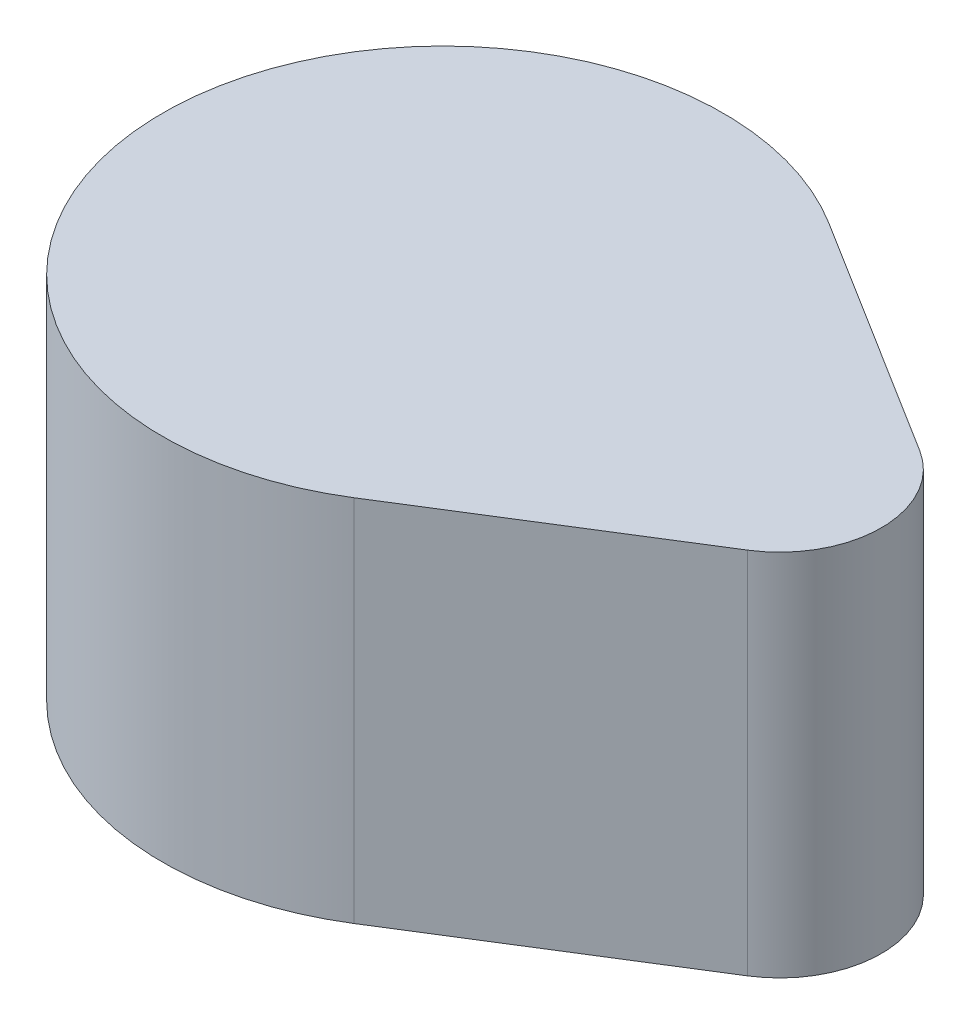
ISO-10303-21;
HEADER;
FILE_DESCRIPTION(('STEP AP214'),'2;1');
FILE_NAME('part.step','',(''),(''),'','','');
FILE_SCHEMA(('AUTOMOTIVE_DESIGN { 1 0 10303 214 1 1 1 1 }'));
ENDSEC;
DATA;
#1=APPLICATION_CONTEXT('core data for automotive mechanical design processes');
#2=APPLICATION_PROTOCOL_DEFINITION('international standard','automotive_design',2000,#1);
#3=PRODUCT_CONTEXT('',#1,'mechanical');
#4=PRODUCT('Part','Part','',(#3));
#5=PRODUCT_RELATED_PRODUCT_CATEGORY('part','',(#4));
#6=PRODUCT_DEFINITION_FORMATION('','',#4);
#7=PRODUCT_DEFINITION_CONTEXT('part definition',#1,'design');
#8=PRODUCT_DEFINITION('design','',#6,#7);
#9=PRODUCT_DEFINITION_SHAPE('','',#8);
#10=(LENGTH_UNIT() NAMED_UNIT(*) SI_UNIT(.MILLI.,.METRE.));
#11=(NAMED_UNIT(*) PLANE_ANGLE_UNIT() SI_UNIT($,.RADIAN.));
#12=(NAMED_UNIT(*) SI_UNIT($,.STERADIAN.) SOLID_ANGLE_UNIT());
#13=UNCERTAINTY_MEASURE_WITH_UNIT(LENGTH_MEASURE(1.E-05),#10,'distance_accuracy_value','');
#14=(GEOMETRIC_REPRESENTATION_CONTEXT(3) GLOBAL_UNCERTAINTY_ASSIGNED_CONTEXT((#13)) GLOBAL_UNIT_ASSIGNED_CONTEXT((#10,
#11,#12)) REPRESENTATION_CONTEXT('',''));
#15=CARTESIAN_POINT('',(0.,0.,0.));
#16=DIRECTION('',(0.,0.,1.));
#17=DIRECTION('',(1.,0.,0.));
#18=AXIS2_PLACEMENT_3D('',#15,#16,#17);
#19=CARTESIAN_POINT('',(0.,12.7,0.));
#20=DIRECTION('',(0.,-1.,0.));
#21=DIRECTION('',(0.,0.,-1.));
#22=AXIS2_PLACEMENT_3D('',#19,#20,#21);
#23=CYLINDRICAL_SURFACE('',#22,9.65);
#24=CARTESIAN_POINT('',(0.,0.,0.));
#25=DIRECTION('',(0.,1.,0.));
#26=DIRECTION('',(0.,0.,1.));
#27=AXIS2_PLACEMENT_3D('',#24,#25,#26);
#28=CIRCLE('',#27,9.65);
#29=CARTESIAN_POINT('',(5.11616379310345,0.,-8.18213713171182));
#30=VERTEX_POINT('',#29);
#31=CARTESIAN_POINT('',(5.11616379310345,0.,8.18213713171182));
#32=VERTEX_POINT('',#31);
#33=EDGE_CURVE('E107',#30,#32,#28,.T.);
#34=ORIENTED_EDGE('',*,*,#33,.T.);
#35=DIRECTION('',(0.,-1.,0.));
#36=VECTOR('',#35,1.);
#37=CARTESIAN_POINT('',(5.11616379310345,12.7,8.18213713171182));
#38=LINE('',#37,#36);
#39=CARTESIAN_POINT('',(5.11616379310345,12.7,8.18213713171182));
#40=VERTEX_POINT('',#39);
#41=EDGE_CURVE('E11',#40,#32,#38,.T.);
#42=ORIENTED_EDGE('',*,*,#41,.F.);
#43=CARTESIAN_POINT('',(0.,12.7,0.));
#44=DIRECTION('',(0.,1.,0.));
#45=DIRECTION('',(0.,0.,1.));
#46=AXIS2_PLACEMENT_3D('',#43,#44,#45);
#47=CIRCLE('',#46,9.65);
#48=CARTESIAN_POINT('',(5.11616379310345,12.7,-8.18213713171182));
#49=VERTEX_POINT('',#48);
#50=EDGE_CURVE('E91',#49,#40,#47,.T.);
#51=ORIENTED_EDGE('',*,*,#50,.F.);
#52=DIRECTION('',(0.,-1.,0.));
#53=VECTOR('',#52,1.);
#54=CARTESIAN_POINT('',(5.11616379310345,12.7,-8.18213713171182));
#55=LINE('',#54,#53);
#56=EDGE_CURVE('E103',#49,#30,#55,.T.);
#57=ORIENTED_EDGE('',*,*,#56,.T.);
#58=EDGE_LOOP('',(#34,#42,#51,#57));
#59=FACE_BOUND('',#58,.T.);
#60=ADVANCED_FACE('F39',(#59),#23,.T.);
#61=CARTESIAN_POINT('',(5.11616379310345,12.7,8.18213713171182));
#62=DIRECTION('',(-0.530172413793103,0.,-0.847889858208479));
#63=DIRECTION('',(-0.847889858208479,0.,0.530172413793103));
#64=AXIS2_PLACEMENT_3D('',#61,#62,#63);
#65=PLANE('',#64);
#66=DIRECTION('',(0.847889858208479,0.,-0.530172413793103));
#67=VECTOR('',#66,1.);
#68=CARTESIAN_POINT('',(5.11616379310345,0.,8.18213713171182));
#69=LINE('',#68,#67);
#70=CARTESIAN_POINT('',(13.4556034482759,0.,2.96761450372968));
#71=VERTEX_POINT('',#70);
#72=EDGE_CURVE('E96',#32,#71,#69,.T.);
#73=ORIENTED_EDGE('',*,*,#72,.T.);
#74=DIRECTION('',(0.,-1.,0.));
#75=VECTOR('',#74,1.);
#76=CARTESIAN_POINT('',(13.4556034482759,12.7,2.96761450372968));
#77=LINE('',#76,#75);
#78=CARTESIAN_POINT('',(13.4556034482759,12.7,2.96761450372968));
#79=VERTEX_POINT('',#78);
#80=EDGE_CURVE('E48',#79,#71,#77,.T.);
#81=ORIENTED_EDGE('',*,*,#80,.F.);
#82=DIRECTION('',(0.847889858208479,0.,-0.530172413793103));
#83=VECTOR('',#82,1.);
#84=CARTESIAN_POINT('',(5.11616379310345,12.7,8.18213713171182));
#85=LINE('',#84,#83);
#86=EDGE_CURVE('E86',#40,#79,#85,.T.);
#87=ORIENTED_EDGE('',*,*,#86,.F.);
#88=ORIENTED_EDGE('',*,*,#41,.T.);
#89=EDGE_LOOP('',(#73,#81,#87,#88));
#90=FACE_BOUND('',#89,.T.);
#91=ADVANCED_FACE('F95',(#90),#65,.F.);
#92=CARTESIAN_POINT('',(11.6,12.7,0.));
#93=DIRECTION('',(0.,-1.,0.));
#94=DIRECTION('',(0.,0.,-1.));
#95=AXIS2_PLACEMENT_3D('',#92,#93,#94);
#96=CYLINDRICAL_SURFACE('',#95,3.5);
#97=CARTESIAN_POINT('',(11.6,0.,0.));
#98=DIRECTION('',(0.,1.,0.));
#99=DIRECTION('',(0.,0.,1.));
#100=AXIS2_PLACEMENT_3D('',#97,#98,#99);
#101=CIRCLE('',#100,3.5);
#102=CARTESIAN_POINT('',(13.4556034482759,0.,-2.96761450372968));
#103=VERTEX_POINT('',#102);
#104=EDGE_CURVE('E73',#71,#103,#101,.T.);
#105=ORIENTED_EDGE('',*,*,#104,.T.);
#106=DIRECTION('',(0.,-1.,0.));
#107=VECTOR('',#106,1.);
#108=CARTESIAN_POINT('',(13.4556034482759,12.7,-2.96761450372968));
#109=LINE('',#108,#107);
#110=CARTESIAN_POINT('',(13.4556034482759,12.7,-2.96761450372968));
#111=VERTEX_POINT('',#110);
#112=EDGE_CURVE('E98',#111,#103,#109,.T.);
#113=ORIENTED_EDGE('',*,*,#112,.F.);
#114=CARTESIAN_POINT('',(11.6,12.7,0.));
#115=DIRECTION('',(0.,1.,0.));
#116=DIRECTION('',(0.,0.,1.));
#117=AXIS2_PLACEMENT_3D('',#114,#115,#116);
#118=CIRCLE('',#117,3.5);
#119=EDGE_CURVE('E89',#79,#111,#118,.T.);
#120=ORIENTED_EDGE('',*,*,#119,.F.);
#121=ORIENTED_EDGE('',*,*,#80,.T.);
#122=EDGE_LOOP('',(#105,#113,#120,#121));
#123=FACE_BOUND('',#122,.T.);
#124=ADVANCED_FACE('F99',(#123),#96,.T.);
#125=CARTESIAN_POINT('',(5.11616379310345,12.7,-8.18213713171182));
#126=DIRECTION('',(-0.530172413793103,0.,0.847889858208479));
#127=DIRECTION('',(0.847889858208479,0.,0.530172413793103));
#128=AXIS2_PLACEMENT_3D('',#125,#126,#127);
#129=PLANE('',#128);
#130=DIRECTION('',(-0.847889858208479,0.,-0.530172413793103));
#131=VECTOR('',#130,1.);
#132=CARTESIAN_POINT('',(5.11616379310345,0.,-8.18213713171182));
#133=LINE('',#132,#131);
#134=EDGE_CURVE('E79',#103,#30,#133,.T.);
#135=ORIENTED_EDGE('',*,*,#134,.T.);
#136=ORIENTED_EDGE('',*,*,#56,.F.);
#137=DIRECTION('',(-0.847889858208479,0.,-0.530172413793103));
#138=VECTOR('',#137,1.);
#139=CARTESIAN_POINT('',(5.11616379310345,12.7,-8.18213713171182));
#140=LINE('',#139,#138);
#141=EDGE_CURVE('E56',#111,#49,#140,.T.);
#142=ORIENTED_EDGE('',*,*,#141,.F.);
#143=ORIENTED_EDGE('',*,*,#112,.T.);
#144=EDGE_LOOP('',(#135,#136,#142,#143));
#145=FACE_BOUND('',#144,.T.);
#146=ADVANCED_FACE('F120',(#145),#129,.F.);
#147=CARTESIAN_POINT('',(0.,12.7,0.));
#148=DIRECTION('',(0.,1.,0.));
#149=DIRECTION('',(0.,0.,1.));
#150=AXIS2_PLACEMENT_3D('',#147,#148,#149);
#151=PLANE('',#150);
#152=ORIENTED_EDGE('',*,*,#50,.T.);
#153=ORIENTED_EDGE('',*,*,#86,.T.);
#154=ORIENTED_EDGE('',*,*,#119,.T.);
#155=ORIENTED_EDGE('',*,*,#141,.T.);
#156=EDGE_LOOP('',(#152,#153,#154,#155));
#157=FACE_BOUND('',#156,.T.);
#158=ADVANCED_FACE('F87',(#157),#151,.T.);
#159=CARTESIAN_POINT('',(0.,0.,0.));
#160=DIRECTION('',(0.,1.,0.));
#161=DIRECTION('',(0.,0.,1.));
#162=AXIS2_PLACEMENT_3D('',#159,#160,#161);
#163=PLANE('',#162);
#164=ORIENTED_EDGE('',*,*,#33,.F.);
#165=ORIENTED_EDGE('',*,*,#134,.F.);
#166=ORIENTED_EDGE('',*,*,#104,.F.);
#167=ORIENTED_EDGE('',*,*,#72,.F.);
#168=EDGE_LOOP('',(#164,#165,#166,#167));
#169=FACE_BOUND('',#168,.T.);
#170=ADVANCED_FACE('F123',(#169),#163,.F.);
#171=CLOSED_SHELL('',(#60,#91,#124,#146,#158,#170));
#172=MANIFOLD_SOLID_BREP('B2',#171);
#173=ADVANCED_BREP_SHAPE_REPRESENTATION('',(#18,#172),#14);
#174=SHAPE_DEFINITION_REPRESENTATION(#9,#173);
ENDSEC;
END-ISO-10303-21;
